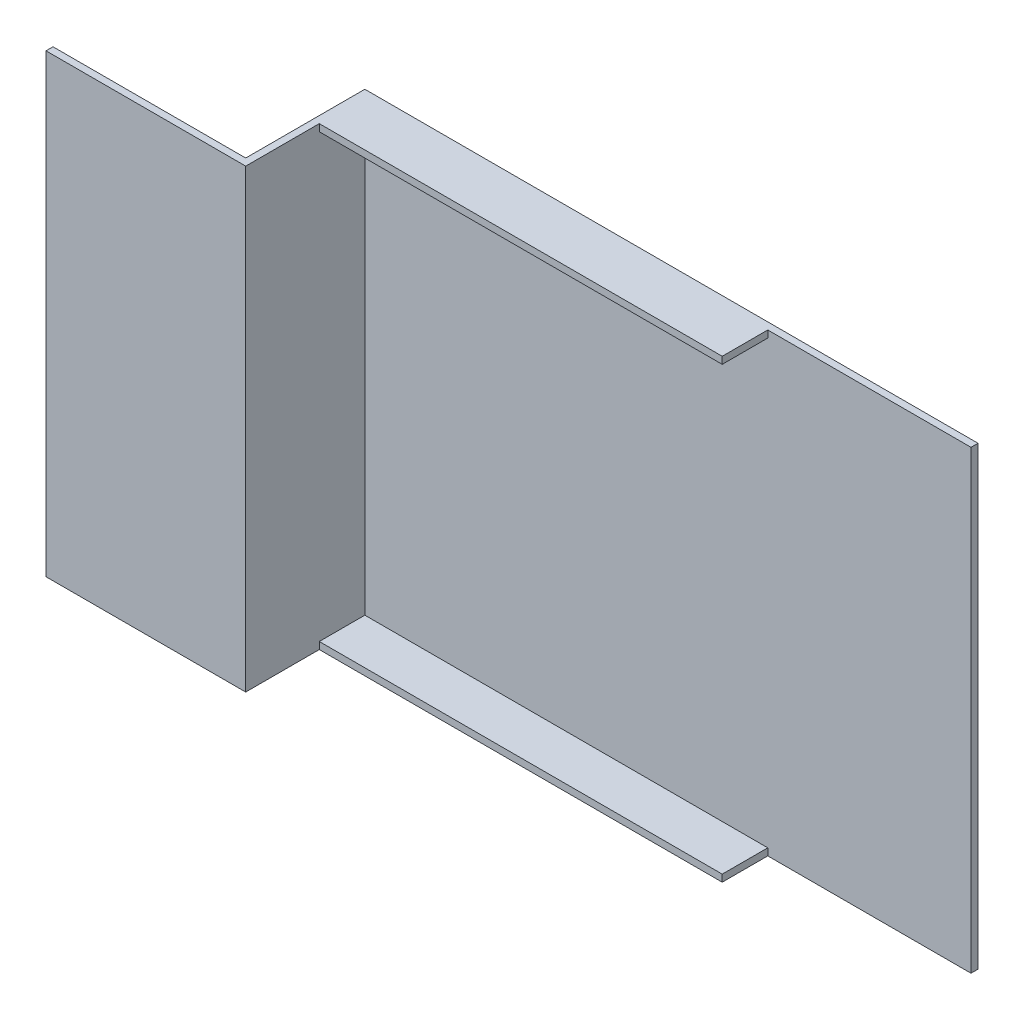
ISO-10303-21;
HEADER;
FILE_DESCRIPTION(('STEP AP214'),'2;1');
FILE_NAME('part.step','',(''),(''),'','','');
FILE_SCHEMA(('AUTOMOTIVE_DESIGN { 1 0 10303 214 1 1 1 1 }'));
ENDSEC;
DATA;
#1=APPLICATION_CONTEXT('core data for automotive mechanical design processes');
#2=APPLICATION_PROTOCOL_DEFINITION('international standard','automotive_design',2000,#1);
#3=PRODUCT_CONTEXT('',#1,'mechanical');
#4=PRODUCT('Part','Part','',(#3));
#5=PRODUCT_RELATED_PRODUCT_CATEGORY('part','',(#4));
#6=PRODUCT_DEFINITION_FORMATION('','',#4);
#7=PRODUCT_DEFINITION_CONTEXT('part definition',#1,'design');
#8=PRODUCT_DEFINITION('design','',#6,#7);
#9=PRODUCT_DEFINITION_SHAPE('','',#8);
#10=(LENGTH_UNIT() NAMED_UNIT(*) SI_UNIT(.MILLI.,.METRE.));
#11=(NAMED_UNIT(*) PLANE_ANGLE_UNIT() SI_UNIT($,.RADIAN.));
#12=(NAMED_UNIT(*) SI_UNIT($,.STERADIAN.) SOLID_ANGLE_UNIT());
#13=UNCERTAINTY_MEASURE_WITH_UNIT(LENGTH_MEASURE(1.E-05),#10,'distance_accuracy_value','');
#14=(GEOMETRIC_REPRESENTATION_CONTEXT(3) GLOBAL_UNCERTAINTY_ASSIGNED_CONTEXT((#13)) GLOBAL_UNIT_ASSIGNED_CONTEXT((#10,
#11,#12)) REPRESENTATION_CONTEXT('',''));
#15=CARTESIAN_POINT('',(0.,0.,0.));
#16=DIRECTION('',(0.,0.,1.));
#17=DIRECTION('',(1.,0.,0.));
#18=AXIS2_PLACEMENT_3D('',#15,#16,#17);
#19=CARTESIAN_POINT('',(0.,0.,2.));
#20=DIRECTION('',(0.,0.,-1.));
#21=DIRECTION('',(-1.,0.,0.));
#22=AXIS2_PLACEMENT_3D('',#19,#20,#21);
#23=PLANE('',#22);
#24=DIRECTION('',(1.,0.,0.));
#25=VECTOR('',#24,1.);
#26=CARTESIAN_POINT('',(2.00000000000001,128.,2.));
#27=LINE('',#26,#25);
#28=CARTESIAN_POINT('',(2.,128.,2.));
#29=VERTEX_POINT('',#28);
#30=CARTESIAN_POINT('',(117.,128.,2.));
#31=VERTEX_POINT('',#30);
#32=EDGE_CURVE('E149',#29,#31,#27,.T.);
#33=ORIENTED_EDGE('',*,*,#32,.F.);
#34=DIRECTION('',(0.,1.,0.));
#35=VECTOR('',#34,1.);
#36=CARTESIAN_POINT('',(2.,130.,2.));
#37=LINE('',#36,#35);
#38=CARTESIAN_POINT('',(2.00000000000002,2.,2.));
#39=VERTEX_POINT('',#38);
#40=EDGE_CURVE('E217',#39,#29,#37,.T.);
#41=ORIENTED_EDGE('',*,*,#40,.F.);
#42=DIRECTION('',(-1.,0.,0.));
#43=VECTOR('',#42,1.);
#44=CARTESIAN_POINT('',(2.00000000000001,2.,2.));
#45=LINE('',#44,#43);
#46=CARTESIAN_POINT('',(117.,2.,2.));
#47=VERTEX_POINT('',#46);
#48=EDGE_CURVE('E169',#47,#39,#45,.T.);
#49=ORIENTED_EDGE('',*,*,#48,.F.);
#50=DIRECTION('',(0.,1.,0.));
#51=VECTOR('',#50,1.);
#52=CARTESIAN_POINT('',(117.,0.,2.));
#53=LINE('',#52,#51);
#54=CARTESIAN_POINT('',(117.,0.,2.));
#55=VERTEX_POINT('',#54);
#56=EDGE_CURVE('E164',#55,#47,#53,.T.);
#57=ORIENTED_EDGE('',*,*,#56,.F.);
#58=DIRECTION('',(1.,0.,0.));
#59=VECTOR('',#58,1.);
#60=CARTESIAN_POINT('',(0.,0.,2.));
#61=LINE('',#60,#59);
#62=CARTESIAN_POINT('',(175.,0.,2.));
#63=VERTEX_POINT('',#62);
#64=EDGE_CURVE('E37',#55,#63,#61,.T.);
#65=ORIENTED_EDGE('',*,*,#64,.T.);
#66=DIRECTION('',(0.,1.,0.));
#67=VECTOR('',#66,1.);
#68=CARTESIAN_POINT('',(175.,0.,2.));
#69=LINE('',#68,#67);
#70=CARTESIAN_POINT('',(175.,130.,2.));
#71=VERTEX_POINT('',#70);
#72=EDGE_CURVE('E225',#63,#71,#69,.T.);
#73=ORIENTED_EDGE('',*,*,#72,.T.);
#74=DIRECTION('',(-1.,0.,0.));
#75=VECTOR('',#74,1.);
#76=CARTESIAN_POINT('',(0.,130.,2.));
#77=LINE('',#76,#75);
#78=CARTESIAN_POINT('',(117.,130.,2.));
#79=VERTEX_POINT('',#78);
#80=EDGE_CURVE('E227',#71,#79,#77,.T.);
#81=ORIENTED_EDGE('',*,*,#80,.T.);
#82=DIRECTION('',(0.,1.,0.));
#83=VECTOR('',#82,1.);
#84=CARTESIAN_POINT('',(117.,130.,2.));
#85=LINE('',#84,#83);
#86=EDGE_CURVE('E51',#31,#79,#85,.T.);
#87=ORIENTED_EDGE('',*,*,#86,.F.);
#88=EDGE_LOOP('',(#33,#41,#49,#57,#65,#73,#81,#87));
#89=FACE_BOUND('',#88,.T.);
#90=ADVANCED_FACE('F33',(#89),#23,.F.);
#91=CARTESIAN_POINT('',(2.,130.,36.));
#92=DIRECTION('',(-1.,0.,0.));
#93=DIRECTION('',(0.,-1.,0.));
#94=AXIS2_PLACEMENT_3D('',#91,#92,#93);
#95=PLANE('',#94);
#96=DIRECTION('',(0.,0.,-1.));
#97=VECTOR('',#96,1.);
#98=CARTESIAN_POINT('',(2.00000000000001,128.,15.));
#99=LINE('',#98,#97);
#100=CARTESIAN_POINT('',(2.,128.,15.));
#101=VERTEX_POINT('',#100);
#102=EDGE_CURVE('E59',#101,#29,#99,.T.);
#103=ORIENTED_EDGE('',*,*,#102,.F.);
#104=DIRECTION('',(0.,-1.,0.));
#105=VECTOR('',#104,1.);
#106=CARTESIAN_POINT('',(2.00000000000001,130.,15.));
#107=LINE('',#106,#105);
#108=CARTESIAN_POINT('',(2.,130.,15.));
#109=VERTEX_POINT('',#108);
#110=EDGE_CURVE('E143',#109,#101,#107,.T.);
#111=ORIENTED_EDGE('',*,*,#110,.F.);
#112=DIRECTION('',(0.,0.,-1.));
#113=VECTOR('',#112,1.);
#114=CARTESIAN_POINT('',(2.,130.,36.));
#115=LINE('',#114,#113);
#116=CARTESIAN_POINT('',(2.,130.,36.));
#117=VERTEX_POINT('',#116);
#118=EDGE_CURVE('E237',#117,#109,#115,.T.);
#119=ORIENTED_EDGE('',*,*,#118,.F.);
#120=DIRECTION('',(0.,1.,0.));
#121=VECTOR('',#120,1.);
#122=CARTESIAN_POINT('',(2.,130.,36.));
#123=LINE('',#122,#121);
#124=CARTESIAN_POINT('',(2.00000000000002,0.,36.));
#125=VERTEX_POINT('',#124);
#126=EDGE_CURVE('E291',#125,#117,#123,.T.);
#127=ORIENTED_EDGE('',*,*,#126,.F.);
#128=DIRECTION('',(0.,0.,-1.));
#129=VECTOR('',#128,1.);
#130=CARTESIAN_POINT('',(2.00000000000002,0.,36.));
#131=LINE('',#130,#129);
#132=CARTESIAN_POINT('',(2.00000000000001,0.,15.));
#133=VERTEX_POINT('',#132);
#134=EDGE_CURVE('E240',#125,#133,#131,.T.);
#135=ORIENTED_EDGE('',*,*,#134,.T.);
#136=DIRECTION('',(0.,-1.,0.));
#137=VECTOR('',#136,1.);
#138=CARTESIAN_POINT('',(2.00000000000001,0.,15.));
#139=LINE('',#138,#137);
#140=CARTESIAN_POINT('',(2.00000000000002,2.,15.));
#141=VERTEX_POINT('',#140);
#142=EDGE_CURVE('E165',#141,#133,#139,.T.);
#143=ORIENTED_EDGE('',*,*,#142,.F.);
#144=DIRECTION('',(0.,0.,-1.));
#145=VECTOR('',#144,1.);
#146=CARTESIAN_POINT('',(2.00000000000001,2.,15.));
#147=LINE('',#146,#145);
#148=EDGE_CURVE('E176',#141,#39,#147,.T.);
#149=ORIENTED_EDGE('',*,*,#148,.T.);
#150=ORIENTED_EDGE('',*,*,#40,.T.);
#151=EDGE_LOOP('',(#103,#111,#119,#127,#135,#143,#149,#150));
#152=FACE_BOUND('',#151,.T.);
#153=ADVANCED_FACE('F292',(#152),#95,.F.);
#154=CARTESIAN_POINT('',(0.,0.,2.));
#155=DIRECTION('',(1.,0.,0.));
#156=DIRECTION('',(0.,0.,-1.));
#157=AXIS2_PLACEMENT_3D('',#154,#155,#156);
#158=PLANE('',#157);
#159=DIRECTION('',(0.,-1.,0.));
#160=VECTOR('',#159,1.);
#161=CARTESIAN_POINT('',(0.,0.,34.));
#162=LINE('',#161,#160);
#163=CARTESIAN_POINT('',(0.,130.,34.));
#164=VERTEX_POINT('',#163);
#165=CARTESIAN_POINT('',(0.,0.,34.));
#166=VERTEX_POINT('',#165);
#167=EDGE_CURVE('E188',#164,#166,#162,.T.);
#168=ORIENTED_EDGE('',*,*,#167,.F.);
#169=DIRECTION('',(0.,0.,-1.));
#170=VECTOR('',#169,1.);
#171=CARTESIAN_POINT('',(0.,130.,2.));
#172=LINE('',#171,#170);
#173=CARTESIAN_POINT('',(0.,130.,0.));
#174=VERTEX_POINT('',#173);
#175=EDGE_CURVE('E208',#164,#174,#172,.T.);
#176=ORIENTED_EDGE('',*,*,#175,.T.);
#177=DIRECTION('',(0.,-1.,0.));
#178=VECTOR('',#177,1.);
#179=CARTESIAN_POINT('',(0.,0.,0.));
#180=LINE('',#179,#178);
#181=CARTESIAN_POINT('',(0.,0.,0.));
#182=VERTEX_POINT('',#181);
#183=EDGE_CURVE('E230',#174,#182,#180,.T.);
#184=ORIENTED_EDGE('',*,*,#183,.T.);
#185=DIRECTION('',(0.,0.,-1.));
#186=VECTOR('',#185,1.);
#187=CARTESIAN_POINT('',(0.,0.,2.));
#188=LINE('',#187,#186);
#189=EDGE_CURVE('E11',#166,#182,#188,.T.);
#190=ORIENTED_EDGE('',*,*,#189,.F.);
#191=EDGE_LOOP('',(#168,#176,#184,#190));
#192=FACE_BOUND('',#191,.T.);
#193=ADVANCED_FACE('F35',(#192),#158,.F.);
#194=CARTESIAN_POINT('',(0.,0.,2.));
#195=DIRECTION('',(0.,1.,0.));
#196=DIRECTION('',(0.,0.,1.));
#197=AXIS2_PLACEMENT_3D('',#194,#195,#196);
#198=PLANE('',#197);
#199=ORIENTED_EDGE('',*,*,#64,.F.);
#200=DIRECTION('',(0.,0.,-1.));
#201=VECTOR('',#200,1.);
#202=CARTESIAN_POINT('',(117.,0.,15.));
#203=LINE('',#202,#201);
#204=CARTESIAN_POINT('',(117.,0.,15.));
#205=VERTEX_POINT('',#204);
#206=EDGE_CURVE('E185',#205,#55,#203,.T.);
#207=ORIENTED_EDGE('',*,*,#206,.F.);
#208=DIRECTION('',(1.,0.,0.));
#209=VECTOR('',#208,1.);
#210=CARTESIAN_POINT('',(2.00000000000001,0.,15.));
#211=LINE('',#210,#209);
#212=EDGE_CURVE('E168',#133,#205,#211,.T.);
#213=ORIENTED_EDGE('',*,*,#212,.F.);
#214=ORIENTED_EDGE('',*,*,#134,.F.);
#215=DIRECTION('',(1.,0.,0.));
#216=VECTOR('',#215,1.);
#217=CARTESIAN_POINT('',(0.,0.,36.));
#218=LINE('',#217,#216);
#219=CARTESIAN_POINT('',(-55.,0.,36.));
#220=VERTEX_POINT('',#219);
#221=EDGE_CURVE('E202',#220,#125,#218,.T.);
#222=ORIENTED_EDGE('',*,*,#221,.F.);
#223=DIRECTION('',(0.,0.,1.));
#224=VECTOR('',#223,1.);
#225=CARTESIAN_POINT('',(-55.,0.,36.));
#226=LINE('',#225,#224);
#227=CARTESIAN_POINT('',(-55.,0.,34.));
#228=VERTEX_POINT('',#227);
#229=EDGE_CURVE('E196',#228,#220,#226,.T.);
#230=ORIENTED_EDGE('',*,*,#229,.F.);
#231=DIRECTION('',(1.,0.,0.));
#232=VECTOR('',#231,1.);
#233=CARTESIAN_POINT('',(-55.,0.,34.));
#234=LINE('',#233,#232);
#235=EDGE_CURVE('E199',#228,#166,#234,.T.);
#236=ORIENTED_EDGE('',*,*,#235,.T.);
#237=ORIENTED_EDGE('',*,*,#189,.T.);
#238=DIRECTION('',(1.,0.,0.));
#239=VECTOR('',#238,1.);
#240=CARTESIAN_POINT('',(0.,0.,0.));
#241=LINE('',#240,#239);
#242=CARTESIAN_POINT('',(175.,0.,0.));
#243=VERTEX_POINT('',#242);
#244=EDGE_CURVE('E249',#182,#243,#241,.T.);
#245=ORIENTED_EDGE('',*,*,#244,.T.);
#246=DIRECTION('',(0.,0.,-1.));
#247=VECTOR('',#246,1.);
#248=CARTESIAN_POINT('',(175.,0.,2.));
#249=LINE('',#248,#247);
#250=EDGE_CURVE('E43',#63,#243,#249,.T.);
#251=ORIENTED_EDGE('',*,*,#250,.F.);
#252=EDGE_LOOP('',(#199,#207,#213,#214,#222,#230,#236,#237,#245,#251));
#253=FACE_BOUND('',#252,.T.);
#254=ADVANCED_FACE('F280',(#253),#198,.F.);
#255=CARTESIAN_POINT('',(175.,0.,2.));
#256=DIRECTION('',(-1.,0.,0.));
#257=DIRECTION('',(0.,0.,1.));
#258=AXIS2_PLACEMENT_3D('',#255,#256,#257);
#259=PLANE('',#258);
#260=DIRECTION('',(0.,1.,0.));
#261=VECTOR('',#260,1.);
#262=CARTESIAN_POINT('',(175.,0.,0.));
#263=LINE('',#262,#261);
#264=CARTESIAN_POINT('',(175.,130.,0.));
#265=VERTEX_POINT('',#264);
#266=EDGE_CURVE('E252',#243,#265,#263,.T.);
#267=ORIENTED_EDGE('',*,*,#266,.T.);
#268=DIRECTION('',(0.,0.,-1.));
#269=VECTOR('',#268,1.);
#270=CARTESIAN_POINT('',(175.,130.,2.));
#271=LINE('',#270,#269);
#272=EDGE_CURVE('E263',#71,#265,#271,.T.);
#273=ORIENTED_EDGE('',*,*,#272,.F.);
#274=ORIENTED_EDGE('',*,*,#72,.F.);
#275=ORIENTED_EDGE('',*,*,#250,.T.);
#276=EDGE_LOOP('',(#267,#273,#274,#275));
#277=FACE_BOUND('',#276,.T.);
#278=ADVANCED_FACE('F268',(#277),#259,.F.);
#279=CARTESIAN_POINT('',(0.,130.,2.));
#280=DIRECTION('',(0.,-1.,0.));
#281=DIRECTION('',(0.,0.,-1.));
#282=AXIS2_PLACEMENT_3D('',#279,#280,#281);
#283=PLANE('',#282);
#284=DIRECTION('',(-1.,0.,0.));
#285=VECTOR('',#284,1.);
#286=CARTESIAN_POINT('',(0.,130.,0.));
#287=LINE('',#286,#285);
#288=EDGE_CURVE('E257',#265,#174,#287,.T.);
#289=ORIENTED_EDGE('',*,*,#288,.T.);
#290=ORIENTED_EDGE('',*,*,#175,.F.);
#291=DIRECTION('',(1.,0.,0.));
#292=VECTOR('',#291,1.);
#293=CARTESIAN_POINT('',(-55.,130.,34.));
#294=LINE('',#293,#292);
#295=CARTESIAN_POINT('',(-55.,130.,34.));
#296=VERTEX_POINT('',#295);
#297=EDGE_CURVE('E212',#296,#164,#294,.T.);
#298=ORIENTED_EDGE('',*,*,#297,.F.);
#299=DIRECTION('',(0.,0.,-1.));
#300=VECTOR('',#299,1.);
#301=CARTESIAN_POINT('',(-55.,130.,36.));
#302=LINE('',#301,#300);
#303=CARTESIAN_POINT('',(-55.,130.,36.));
#304=VERTEX_POINT('',#303);
#305=EDGE_CURVE('E192',#304,#296,#302,.T.);
#306=ORIENTED_EDGE('',*,*,#305,.F.);
#307=DIRECTION('',(-1.,0.,0.));
#308=VECTOR('',#307,1.);
#309=CARTESIAN_POINT('',(0.,130.,36.));
#310=LINE('',#309,#308);
#311=EDGE_CURVE('E222',#117,#304,#310,.T.);
#312=ORIENTED_EDGE('',*,*,#311,.F.);
#313=ORIENTED_EDGE('',*,*,#118,.T.);
#314=DIRECTION('',(-1.,0.,0.));
#315=VECTOR('',#314,1.);
#316=CARTESIAN_POINT('',(2.00000000000001,130.,15.));
#317=LINE('',#316,#315);
#318=CARTESIAN_POINT('',(117.,130.,15.));
#319=VERTEX_POINT('',#318);
#320=EDGE_CURVE('E161',#319,#109,#317,.T.);
#321=ORIENTED_EDGE('',*,*,#320,.F.);
#322=DIRECTION('',(0.,0.,-1.));
#323=VECTOR('',#322,1.);
#324=CARTESIAN_POINT('',(117.,130.,15.));
#325=LINE('',#324,#323);
#326=EDGE_CURVE('E151',#319,#79,#325,.T.);
#327=ORIENTED_EDGE('',*,*,#326,.T.);
#328=ORIENTED_EDGE('',*,*,#80,.F.);
#329=ORIENTED_EDGE('',*,*,#272,.T.);
#330=EDGE_LOOP('',(#289,#290,#298,#306,#312,#313,#321,#327,#328,#329));
#331=FACE_BOUND('',#330,.T.);
#332=ADVANCED_FACE('F276',(#331),#283,.F.);
#333=CARTESIAN_POINT('',(0.,0.,0.));
#334=DIRECTION('',(0.,0.,-1.));
#335=DIRECTION('',(-1.,0.,0.));
#336=AXIS2_PLACEMENT_3D('',#333,#334,#335);
#337=PLANE('',#336);
#338=ORIENTED_EDGE('',*,*,#183,.F.);
#339=ORIENTED_EDGE('',*,*,#288,.F.);
#340=ORIENTED_EDGE('',*,*,#266,.F.);
#341=ORIENTED_EDGE('',*,*,#244,.F.);
#342=EDGE_LOOP('',(#338,#339,#340,#341));
#343=FACE_BOUND('',#342,.T.);
#344=ADVANCED_FACE('F273',(#343),#337,.T.);
#345=CARTESIAN_POINT('',(0.,0.,36.));
#346=DIRECTION('',(0.,0.,1.));
#347=DIRECTION('',(1.,0.,0.));
#348=AXIS2_PLACEMENT_3D('',#345,#346,#347);
#349=PLANE('',#348);
#350=ORIENTED_EDGE('',*,*,#311,.T.);
#351=DIRECTION('',(0.,1.,0.));
#352=VECTOR('',#351,1.);
#353=CARTESIAN_POINT('',(-55.,0.,36.));
#354=LINE('',#353,#352);
#355=EDGE_CURVE('E189',#220,#304,#354,.T.);
#356=ORIENTED_EDGE('',*,*,#355,.F.);
#357=ORIENTED_EDGE('',*,*,#221,.T.);
#358=ORIENTED_EDGE('',*,*,#126,.T.);
#359=EDGE_LOOP('',(#350,#356,#357,#358));
#360=FACE_BOUND('',#359,.T.);
#361=ADVANCED_FACE('F296',(#360),#349,.T.);
#362=CARTESIAN_POINT('',(-55.,0.,34.));
#363=DIRECTION('',(0.,0.,1.));
#364=DIRECTION('',(1.,0.,0.));
#365=AXIS2_PLACEMENT_3D('',#362,#363,#364);
#366=PLANE('',#365);
#367=ORIENTED_EDGE('',*,*,#167,.T.);
#368=ORIENTED_EDGE('',*,*,#235,.F.);
#369=DIRECTION('',(0.,-1.,0.));
#370=VECTOR('',#369,1.);
#371=CARTESIAN_POINT('',(-55.,0.,34.));
#372=LINE('',#371,#370);
#373=EDGE_CURVE('E194',#296,#228,#372,.T.);
#374=ORIENTED_EDGE('',*,*,#373,.F.);
#375=ORIENTED_EDGE('',*,*,#297,.T.);
#376=EDGE_LOOP('',(#367,#368,#374,#375));
#377=FACE_BOUND('',#376,.T.);
#378=ADVANCED_FACE('F303',(#377),#366,.F.);
#379=CARTESIAN_POINT('',(-55.,0.,0.));
#380=DIRECTION('',(-1.,0.,0.));
#381=DIRECTION('',(0.,0.,1.));
#382=AXIS2_PLACEMENT_3D('',#379,#380,#381);
#383=PLANE('',#382);
#384=ORIENTED_EDGE('',*,*,#355,.T.);
#385=ORIENTED_EDGE('',*,*,#305,.T.);
#386=ORIENTED_EDGE('',*,*,#373,.T.);
#387=ORIENTED_EDGE('',*,*,#229,.T.);
#388=EDGE_LOOP('',(#384,#385,#386,#387));
#389=FACE_BOUND('',#388,.T.);
#390=ADVANCED_FACE('F299',(#389),#383,.T.);
#391=CARTESIAN_POINT('',(117.,0.,15.));
#392=DIRECTION('',(-1.,0.,0.));
#393=DIRECTION('',(0.,0.,1.));
#394=AXIS2_PLACEMENT_3D('',#391,#392,#393);
#395=PLANE('',#394);
#396=ORIENTED_EDGE('',*,*,#56,.T.);
#397=DIRECTION('',(0.,0.,-1.));
#398=VECTOR('',#397,1.);
#399=CARTESIAN_POINT('',(117.,2.,15.));
#400=LINE('',#399,#398);
#401=CARTESIAN_POINT('',(117.,2.,15.));
#402=VERTEX_POINT('',#401);
#403=EDGE_CURVE('E182',#402,#47,#400,.T.);
#404=ORIENTED_EDGE('',*,*,#403,.F.);
#405=DIRECTION('',(0.,1.,0.));
#406=VECTOR('',#405,1.);
#407=CARTESIAN_POINT('',(117.,0.,15.));
#408=LINE('',#407,#406);
#409=EDGE_CURVE('E171',#205,#402,#408,.T.);
#410=ORIENTED_EDGE('',*,*,#409,.F.);
#411=ORIENTED_EDGE('',*,*,#206,.T.);
#412=EDGE_LOOP('',(#396,#404,#410,#411));
#413=FACE_BOUND('',#412,.T.);
#414=ADVANCED_FACE('F283',(#413),#395,.F.);
#415=CARTESIAN_POINT('',(2.00000000000001,2.,15.));
#416=DIRECTION('',(0.,-1.,0.));
#417=DIRECTION('',(0.,0.,-1.));
#418=AXIS2_PLACEMENT_3D('',#415,#416,#417);
#419=PLANE('',#418);
#420=ORIENTED_EDGE('',*,*,#48,.T.);
#421=ORIENTED_EDGE('',*,*,#148,.F.);
#422=DIRECTION('',(-1.,0.,0.));
#423=VECTOR('',#422,1.);
#424=CARTESIAN_POINT('',(2.00000000000001,2.,15.));
#425=LINE('',#424,#423);
#426=EDGE_CURVE('E173',#402,#141,#425,.T.);
#427=ORIENTED_EDGE('',*,*,#426,.F.);
#428=ORIENTED_EDGE('',*,*,#403,.T.);
#429=EDGE_LOOP('',(#420,#421,#427,#428));
#430=FACE_BOUND('',#429,.T.);
#431=ADVANCED_FACE('F356',(#430),#419,.F.);
#432=CARTESIAN_POINT('',(0.,0.,15.));
#433=DIRECTION('',(0.,0.,-1.));
#434=DIRECTION('',(-1.,0.,0.));
#435=AXIS2_PLACEMENT_3D('',#432,#433,#434);
#436=PLANE('',#435);
#437=ORIENTED_EDGE('',*,*,#142,.T.);
#438=ORIENTED_EDGE('',*,*,#212,.T.);
#439=ORIENTED_EDGE('',*,*,#409,.T.);
#440=ORIENTED_EDGE('',*,*,#426,.T.);
#441=EDGE_LOOP('',(#437,#438,#439,#440));
#442=FACE_BOUND('',#441,.T.);
#443=ADVANCED_FACE('F287',(#442),#436,.F.);
#444=CARTESIAN_POINT('',(2.00000000000001,128.,15.));
#445=DIRECTION('',(0.,1.,0.));
#446=DIRECTION('',(-1.,0.,0.));
#447=AXIS2_PLACEMENT_3D('',#444,#445,#446);
#448=PLANE('',#447);
#449=ORIENTED_EDGE('',*,*,#32,.T.);
#450=DIRECTION('',(0.,0.,-1.));
#451=VECTOR('',#450,1.);
#452=CARTESIAN_POINT('',(117.,128.,15.));
#453=LINE('',#452,#451);
#454=CARTESIAN_POINT('',(117.,128.,15.));
#455=VERTEX_POINT('',#454);
#456=EDGE_CURVE('E147',#455,#31,#453,.T.);
#457=ORIENTED_EDGE('',*,*,#456,.F.);
#458=DIRECTION('',(1.,0.,0.));
#459=VECTOR('',#458,1.);
#460=CARTESIAN_POINT('',(2.00000000000001,128.,15.));
#461=LINE('',#460,#459);
#462=EDGE_CURVE('E136',#101,#455,#461,.T.);
#463=ORIENTED_EDGE('',*,*,#462,.F.);
#464=ORIENTED_EDGE('',*,*,#102,.T.);
#465=EDGE_LOOP('',(#449,#457,#463,#464));
#466=FACE_BOUND('',#465,.T.);
#467=ADVANCED_FACE('F148',(#466),#448,.F.);
#468=CARTESIAN_POINT('',(117.,130.,15.));
#469=DIRECTION('',(-1.,0.,0.));
#470=DIRECTION('',(0.,0.,1.));
#471=AXIS2_PLACEMENT_3D('',#468,#469,#470);
#472=PLANE('',#471);
#473=ORIENTED_EDGE('',*,*,#86,.T.);
#474=ORIENTED_EDGE('',*,*,#326,.F.);
#475=DIRECTION('',(0.,1.,0.));
#476=VECTOR('',#475,1.);
#477=CARTESIAN_POINT('',(117.,130.,15.));
#478=LINE('',#477,#476);
#479=EDGE_CURVE('E141',#455,#319,#478,.T.);
#480=ORIENTED_EDGE('',*,*,#479,.F.);
#481=ORIENTED_EDGE('',*,*,#456,.T.);
#482=EDGE_LOOP('',(#473,#474,#480,#481));
#483=FACE_BOUND('',#482,.T.);
#484=ADVANCED_FACE('F153',(#483),#472,.F.);
#485=CARTESIAN_POINT('',(0.,0.,15.));
#486=DIRECTION('',(0.,0.,-1.));
#487=DIRECTION('',(-1.,0.,0.));
#488=AXIS2_PLACEMENT_3D('',#485,#486,#487);
#489=PLANE('',#488);
#490=ORIENTED_EDGE('',*,*,#320,.T.);
#491=ORIENTED_EDGE('',*,*,#110,.T.);
#492=ORIENTED_EDGE('',*,*,#462,.T.);
#493=ORIENTED_EDGE('',*,*,#479,.T.);
#494=EDGE_LOOP('',(#490,#491,#492,#493));
#495=FACE_BOUND('',#494,.T.);
#496=ADVANCED_FACE('F139',(#495),#489,.F.);
#497=CLOSED_SHELL('',(#90,#153,#193,#254,#278,#332,#344,#361,#378,#390,#414,#431,#443,#467,#484,#496));
#498=MANIFOLD_SOLID_BREP('B2',#497);
#499=ADVANCED_BREP_SHAPE_REPRESENTATION('',(#18,#498),#14);
#500=SHAPE_DEFINITION_REPRESENTATION(#9,#499);
ENDSEC;
END-ISO-10303-21;
